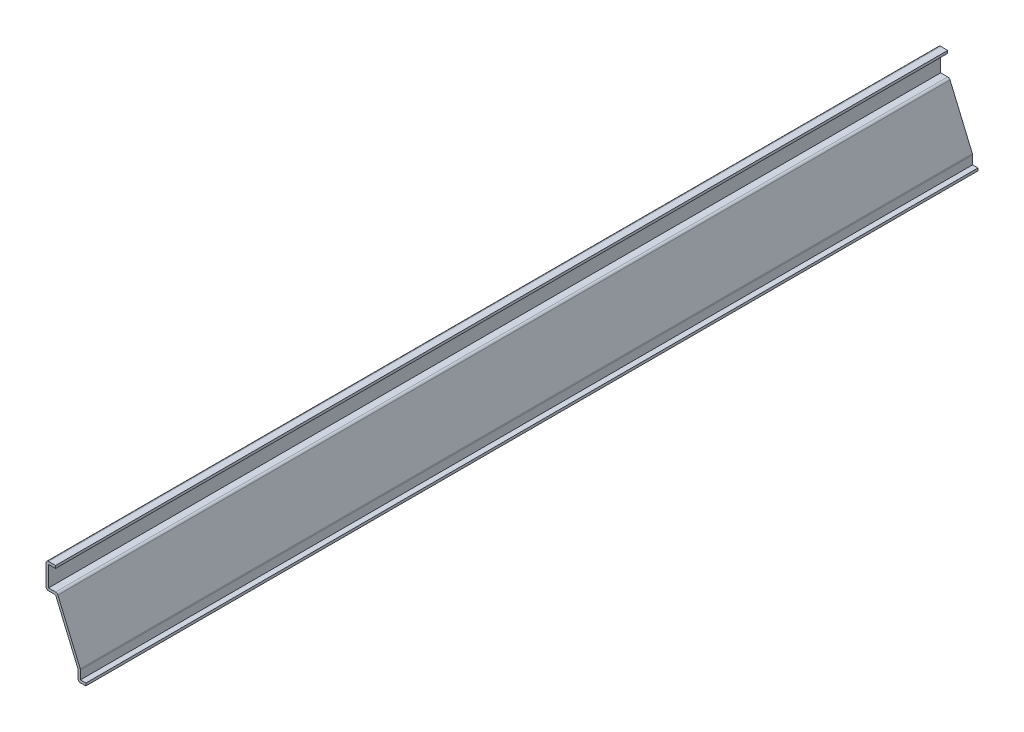
ISO-10303-21;
HEADER;
FILE_DESCRIPTION(('STEP AP214'),'2;1');
FILE_NAME('part.step','',(''),(''),'','','');
FILE_SCHEMA(('AUTOMOTIVE_DESIGN { 1 0 10303 214 1 1 1 1 }'));
ENDSEC;
DATA;
#1=APPLICATION_CONTEXT('core data for automotive mechanical design processes');
#2=APPLICATION_PROTOCOL_DEFINITION('international standard','automotive_design',2000,#1);
#3=PRODUCT_CONTEXT('',#1,'mechanical');
#4=PRODUCT('Part','Part','',(#3));
#5=PRODUCT_RELATED_PRODUCT_CATEGORY('part','',(#4));
#6=PRODUCT_DEFINITION_FORMATION('','',#4);
#7=PRODUCT_DEFINITION_CONTEXT('part definition',#1,'design');
#8=PRODUCT_DEFINITION('design','',#6,#7);
#9=PRODUCT_DEFINITION_SHAPE('','',#8);
#10=(LENGTH_UNIT() NAMED_UNIT(*) SI_UNIT(.MILLI.,.METRE.));
#11=(NAMED_UNIT(*) PLANE_ANGLE_UNIT() SI_UNIT($,.RADIAN.));
#12=(NAMED_UNIT(*) SI_UNIT($,.STERADIAN.) SOLID_ANGLE_UNIT());
#13=UNCERTAINTY_MEASURE_WITH_UNIT(LENGTH_MEASURE(1.E-05),#10,'distance_accuracy_value','');
#14=(GEOMETRIC_REPRESENTATION_CONTEXT(3) GLOBAL_UNCERTAINTY_ASSIGNED_CONTEXT((#13)) GLOBAL_UNIT_ASSIGNED_CONTEXT((#10,
#11,#12)) REPRESENTATION_CONTEXT('',''));
#15=CARTESIAN_POINT('',(0.,0.,0.));
#16=DIRECTION('',(0.,0.,1.));
#17=DIRECTION('',(1.,0.,0.));
#18=AXIS2_PLACEMENT_3D('',#15,#16,#17);
#19=CARTESIAN_POINT('',(-19.84375,43.18,-444.5));
#20=DIRECTION('',(0.,-1.,0.));
#21=DIRECTION('',(0.,0.,-1.));
#22=AXIS2_PLACEMENT_3D('',#19,#20,#21);
#23=PLANE('',#22);
#24=DIRECTION('',(1.,0.,0.));
#25=VECTOR('',#24,1.);
#26=CARTESIAN_POINT('',(-19.84375,43.18,0.));
#27=LINE('',#26,#25);
#28=CARTESIAN_POINT('',(-18.57375,43.18,0.));
#29=VERTEX_POINT('',#28);
#30=CARTESIAN_POINT('',(-15.08125,43.18,0.));
#31=VERTEX_POINT('',#30);
#32=EDGE_CURVE('E224',#29,#31,#27,.T.);
#33=ORIENTED_EDGE('',*,*,#32,.F.);
#34=DIRECTION('',(0.,0.,1.));
#35=VECTOR('',#34,1.);
#36=CARTESIAN_POINT('',(-18.57375,43.18,-444.5));
#37=LINE('',#36,#35);
#38=CARTESIAN_POINT('',(-18.57375,43.18,-444.5));
#39=VERTEX_POINT('',#38);
#40=EDGE_CURVE('E191',#39,#29,#37,.T.);
#41=ORIENTED_EDGE('',*,*,#40,.F.);
#42=DIRECTION('',(1.,0.,0.));
#43=VECTOR('',#42,1.);
#44=CARTESIAN_POINT('',(-19.84375,43.18,-444.5));
#45=LINE('',#44,#43);
#46=CARTESIAN_POINT('',(-15.08125,43.18,-444.5));
#47=VERTEX_POINT('',#46);
#48=EDGE_CURVE('E173',#39,#47,#45,.T.);
#49=ORIENTED_EDGE('',*,*,#48,.T.);
#50=DIRECTION('',(0.,0.,1.));
#51=VECTOR('',#50,1.);
#52=CARTESIAN_POINT('',(-15.08125,43.18,-444.5));
#53=LINE('',#52,#51);
#54=EDGE_CURVE('E181',#47,#31,#53,.T.);
#55=ORIENTED_EDGE('',*,*,#54,.T.);
#56=EDGE_LOOP('',(#33,#41,#49,#55));
#57=FACE_BOUND('',#56,.T.);
#58=ADVANCED_FACE('F35',(#57),#23,.T.);
#59=CARTESIAN_POINT('',(-18.57375,31.75,-444.5));
#60=DIRECTION('',(1.,0.,0.));
#61=DIRECTION('',(0.,0.,-1.));
#62=AXIS2_PLACEMENT_3D('',#59,#60,#61);
#63=PLANE('',#62);
#64=DIRECTION('',(0.,1.,0.));
#65=VECTOR('',#64,1.);
#66=CARTESIAN_POINT('',(-18.57375,31.75,0.));
#67=LINE('',#66,#65);
#68=CARTESIAN_POINT('',(-18.57375,33.02,0.));
#69=VERTEX_POINT('',#68);
#70=EDGE_CURVE('E192',#69,#29,#67,.T.);
#71=ORIENTED_EDGE('',*,*,#70,.F.);
#72=DIRECTION('',(0.,0.,1.));
#73=VECTOR('',#72,1.);
#74=CARTESIAN_POINT('',(-18.57375,33.02,-444.5));
#75=LINE('',#74,#73);
#76=CARTESIAN_POINT('',(-18.57375,33.02,-444.5));
#77=VERTEX_POINT('',#76);
#78=EDGE_CURVE('E255',#77,#69,#75,.T.);
#79=ORIENTED_EDGE('',*,*,#78,.F.);
#80=DIRECTION('',(0.,1.,0.));
#81=VECTOR('',#80,1.);
#82=CARTESIAN_POINT('',(-18.57375,31.75,-444.5));
#83=LINE('',#82,#81);
#84=EDGE_CURVE('E189',#77,#39,#83,.T.);
#85=ORIENTED_EDGE('',*,*,#84,.T.);
#86=ORIENTED_EDGE('',*,*,#40,.T.);
#87=EDGE_LOOP('',(#71,#79,#85,#86));
#88=FACE_BOUND('',#87,.T.);
#89=ADVANCED_FACE('F333',(#88),#63,.T.);
#90=CARTESIAN_POINT('',(-15.08125,33.02,-444.5));
#91=DIRECTION('',(0.,1.,0.));
#92=DIRECTION('',(0.,0.,1.));
#93=AXIS2_PLACEMENT_3D('',#90,#91,#92);
#94=PLANE('',#93);
#95=DIRECTION('',(1.,0.,0.));
#96=VECTOR('',#95,1.);
#97=CARTESIAN_POINT('',(-15.08125,33.02,0.));
#98=LINE('',#97,#96);
#99=CARTESIAN_POINT('',(-15.08125,33.02,0.));
#100=VERTEX_POINT('',#99);
#101=EDGE_CURVE('E195',#100,#69,#98,.F.);
#102=ORIENTED_EDGE('',*,*,#101,.F.);
#103=DIRECTION('',(0.,0.,1.));
#104=VECTOR('',#103,1.);
#105=CARTESIAN_POINT('',(-15.08125,33.02,-444.5));
#106=LINE('',#105,#104);
#107=CARTESIAN_POINT('',(-15.08125,33.02,-444.5));
#108=VERTEX_POINT('',#107);
#109=EDGE_CURVE('E303',#100,#108,#106,.F.);
#110=ORIENTED_EDGE('',*,*,#109,.T.);
#111=DIRECTION('',(1.,0.,0.));
#112=VECTOR('',#111,1.);
#113=CARTESIAN_POINT('',(-15.08125,33.02,-444.5));
#114=LINE('',#113,#112);
#115=EDGE_CURVE('E221',#108,#77,#114,.F.);
#116=ORIENTED_EDGE('',*,*,#115,.T.);
#117=ORIENTED_EDGE('',*,*,#78,.T.);
#118=EDGE_LOOP('',(#102,#110,#116,#117));
#119=FACE_BOUND('',#118,.T.);
#120=ADVANCED_FACE('F392',(#119),#94,.T.);
#121=CARTESIAN_POINT('',(-2.79961113701842,6.05224830550733,-444.5));
#122=DIRECTION('',(0.920581781875257,0.39054984685617,0.));
#123=DIRECTION('',(-0.39054984685617,0.920581781875257,0.));
#124=AXIS2_PLACEMENT_3D('',#121,#122,#123);
#125=PLANE('',#124);
#126=DIRECTION('',(-0.39054984685617,0.920581781875257,0.));
#127=VECTOR('',#126,1.);
#128=CARTESIAN_POINT('',(-2.79961113701842,6.05224830550733,0.));
#129=LINE('',#128,#127);
#130=CARTESIAN_POINT('',(-2.79961113701842,6.05224830550733,0.));
#131=VERTEX_POINT('',#130);
#132=CARTESIAN_POINT('',(-13.9121111370184,32.2459983055073,0.));
#133=VERTEX_POINT('',#132);
#134=EDGE_CURVE('E249',#131,#133,#129,.T.);
#135=ORIENTED_EDGE('',*,*,#134,.F.);
#136=DIRECTION('',(0.,0.,1.));
#137=VECTOR('',#136,1.);
#138=CARTESIAN_POINT('',(-2.79961113701842,6.05224830550733,-444.5));
#139=LINE('',#138,#137);
#140=CARTESIAN_POINT('',(-2.79961113701842,6.05224830550733,-444.5));
#141=VERTEX_POINT('',#140);
#142=EDGE_CURVE('E301',#131,#141,#139,.F.);
#143=ORIENTED_EDGE('',*,*,#142,.T.);
#144=DIRECTION('',(-0.39054984685617,0.920581781875257,0.));
#145=VECTOR('',#144,1.);
#146=CARTESIAN_POINT('',(-2.79961113701842,6.05224830550733,-444.5));
#147=LINE('',#146,#145);
#148=CARTESIAN_POINT('',(-13.9121111370184,32.2459983055073,-444.5));
#149=VERTEX_POINT('',#148);
#150=EDGE_CURVE('E218',#141,#149,#147,.T.);
#151=ORIENTED_EDGE('',*,*,#150,.T.);
#152=DIRECTION('',(0.,0.,1.));
#153=VECTOR('',#152,1.);
#154=CARTESIAN_POINT('',(-13.9121111370184,32.2459983055073,-444.5));
#155=LINE('',#154,#153);
#156=EDGE_CURVE('E298',#149,#133,#155,.T.);
#157=ORIENTED_EDGE('',*,*,#156,.T.);
#158=EDGE_LOOP('',(#135,#143,#151,#157));
#159=FACE_BOUND('',#158,.T.);
#160=ADVANCED_FACE('F344',(#159),#125,.T.);
#161=CARTESIAN_POINT('',(-2.69875,0.,-444.5));
#162=DIRECTION('',(1.,0.,0.));
#163=DIRECTION('',(0.,0.,-1.));
#164=AXIS2_PLACEMENT_3D('',#161,#162,#163);
#165=PLANE('',#164);
#166=DIRECTION('',(0.,1.,0.));
#167=VECTOR('',#166,1.);
#168=CARTESIAN_POINT('',(-2.69875,0.,-444.5));
#169=LINE('',#168,#167);
#170=CARTESIAN_POINT('',(-2.69875,1.27,-444.5));
#171=VERTEX_POINT('',#170);
#172=CARTESIAN_POINT('',(-2.69875,5.55625,-444.5));
#173=VERTEX_POINT('',#172);
#174=EDGE_CURVE('E215',#171,#173,#169,.T.);
#175=ORIENTED_EDGE('',*,*,#174,.T.);
#176=DIRECTION('',(0.,0.,1.));
#177=VECTOR('',#176,1.);
#178=CARTESIAN_POINT('',(-2.69875,5.55625,-444.5));
#179=LINE('',#178,#177);
#180=CARTESIAN_POINT('',(-2.69875,5.55625,0.));
#181=VERTEX_POINT('',#180);
#182=EDGE_CURVE('E295',#173,#181,#179,.T.);
#183=ORIENTED_EDGE('',*,*,#182,.T.);
#184=DIRECTION('',(0.,1.,0.));
#185=VECTOR('',#184,1.);
#186=CARTESIAN_POINT('',(-2.69875,0.,0.));
#187=LINE('',#186,#185);
#188=CARTESIAN_POINT('',(-2.69875,1.27,0.));
#189=VERTEX_POINT('',#188);
#190=EDGE_CURVE('E246',#189,#181,#187,.T.);
#191=ORIENTED_EDGE('',*,*,#190,.F.);
#192=DIRECTION('',(0.,0.,1.));
#193=VECTOR('',#192,1.);
#194=CARTESIAN_POINT('',(-2.69875,1.27,-444.5));
#195=LINE('',#194,#193);
#196=EDGE_CURVE('E258',#171,#189,#195,.T.);
#197=ORIENTED_EDGE('',*,*,#196,.F.);
#198=EDGE_LOOP('',(#175,#183,#191,#197));
#199=FACE_BOUND('',#198,.T.);
#200=ADVANCED_FACE('F352',(#199),#165,.T.);
#201=CARTESIAN_POINT('',(0.,1.27,-444.5));
#202=DIRECTION('',(0.,1.,0.));
#203=DIRECTION('',(0.,0.,1.));
#204=AXIS2_PLACEMENT_3D('',#201,#202,#203);
#205=PLANE('',#204);
#206=DIRECTION('',(1.,0.,0.));
#207=VECTOR('',#206,1.);
#208=CARTESIAN_POINT('',(0.,1.27,0.));
#209=LINE('',#208,#207);
#210=CARTESIAN_POINT('',(0.,1.27,0.));
#211=VERTEX_POINT('',#210);
#212=EDGE_CURVE('E243',#211,#189,#209,.F.);
#213=ORIENTED_EDGE('',*,*,#212,.F.);
#214=DIRECTION('',(0.,0.,1.));
#215=VECTOR('',#214,1.);
#216=CARTESIAN_POINT('',(0.,1.27,-444.5));
#217=LINE('',#216,#215);
#218=CARTESIAN_POINT('',(0.,1.27,-444.5));
#219=VERTEX_POINT('',#218);
#220=EDGE_CURVE('E260',#219,#211,#217,.T.);
#221=ORIENTED_EDGE('',*,*,#220,.F.);
#222=DIRECTION('',(1.,0.,0.));
#223=VECTOR('',#222,1.);
#224=CARTESIAN_POINT('',(0.,1.27,-444.5));
#225=LINE('',#224,#223);
#226=EDGE_CURVE('E212',#219,#171,#225,.F.);
#227=ORIENTED_EDGE('',*,*,#226,.T.);
#228=ORIENTED_EDGE('',*,*,#196,.T.);
#229=EDGE_LOOP('',(#213,#221,#227,#228));
#230=FACE_BOUND('',#229,.T.);
#231=ADVANCED_FACE('F357',(#230),#205,.T.);
#232=CARTESIAN_POINT('',(0.,1.27,-444.5));
#233=DIRECTION('',(-1.,0.,0.));
#234=DIRECTION('',(0.,0.,1.));
#235=AXIS2_PLACEMENT_3D('',#232,#233,#234);
#236=PLANE('',#235);
#237=DIRECTION('',(0.,-1.,0.));
#238=VECTOR('',#237,1.);
#239=CARTESIAN_POINT('',(0.,1.27,0.));
#240=LINE('',#239,#238);
#241=CARTESIAN_POINT('',(0.,0.,0.));
#242=VERTEX_POINT('',#241);
#243=EDGE_CURVE('E241',#211,#242,#240,.T.);
#244=ORIENTED_EDGE('',*,*,#243,.T.);
#245=DIRECTION('',(0.,0.,1.));
#246=VECTOR('',#245,1.);
#247=CARTESIAN_POINT('',(0.,0.,-444.5));
#248=LINE('',#247,#246);
#249=CARTESIAN_POINT('',(0.,0.,-444.5));
#250=VERTEX_POINT('',#249);
#251=EDGE_CURVE('E262',#250,#242,#248,.T.);
#252=ORIENTED_EDGE('',*,*,#251,.F.);
#253=DIRECTION('',(0.,-1.,0.));
#254=VECTOR('',#253,1.);
#255=CARTESIAN_POINT('',(0.,1.27,-444.5));
#256=LINE('',#255,#254);
#257=EDGE_CURVE('E210',#219,#250,#256,.T.);
#258=ORIENTED_EDGE('',*,*,#257,.F.);
#259=ORIENTED_EDGE('',*,*,#220,.T.);
#260=EDGE_LOOP('',(#244,#252,#258,#259));
#261=FACE_BOUND('',#260,.T.);
#262=ADVANCED_FACE('F362',(#261),#236,.F.);
#263=CARTESIAN_POINT('',(0.,0.,-444.5));
#264=DIRECTION('',(0.,1.,0.));
#265=DIRECTION('',(0.,0.,1.));
#266=AXIS2_PLACEMENT_3D('',#263,#264,#265);
#267=PLANE('',#266);
#268=DIRECTION('',(-1.,0.,0.));
#269=VECTOR('',#268,1.);
#270=CARTESIAN_POINT('',(0.,0.,0.));
#271=LINE('',#270,#269);
#272=CARTESIAN_POINT('',(-2.69875,0.,0.));
#273=VERTEX_POINT('',#272);
#274=EDGE_CURVE('E238',#242,#273,#271,.T.);
#275=ORIENTED_EDGE('',*,*,#274,.T.);
#276=DIRECTION('',(0.,0.,1.));
#277=VECTOR('',#276,1.);
#278=CARTESIAN_POINT('',(-2.69875,0.,-444.5));
#279=LINE('',#278,#277);
#280=CARTESIAN_POINT('',(-2.69875,0.,-444.5));
#281=VERTEX_POINT('',#280);
#282=EDGE_CURVE('E284',#273,#281,#279,.F.);
#283=ORIENTED_EDGE('',*,*,#282,.T.);
#284=DIRECTION('',(-1.,0.,0.));
#285=VECTOR('',#284,1.);
#286=CARTESIAN_POINT('',(0.,0.,-444.5));
#287=LINE('',#286,#285);
#288=EDGE_CURVE('E208',#250,#281,#287,.T.);
#289=ORIENTED_EDGE('',*,*,#288,.F.);
#290=ORIENTED_EDGE('',*,*,#251,.T.);
#291=EDGE_LOOP('',(#275,#283,#289,#290));
#292=FACE_BOUND('',#291,.T.);
#293=ADVANCED_FACE('F385',(#292),#267,.F.);
#294=CARTESIAN_POINT('',(-3.96875,0.,-444.5));
#295=DIRECTION('',(1.,0.,0.));
#296=DIRECTION('',(0.,0.,-1.));
#297=AXIS2_PLACEMENT_3D('',#294,#295,#296);
#298=PLANE('',#297);
#299=DIRECTION('',(0.,1.,0.));
#300=VECTOR('',#299,1.);
#301=CARTESIAN_POINT('',(-3.96875,0.,-444.5));
#302=LINE('',#301,#300);
#303=CARTESIAN_POINT('',(-3.96875,1.27,-444.5));
#304=VERTEX_POINT('',#303);
#305=CARTESIAN_POINT('',(-3.96875,5.55625,-444.5));
#306=VERTEX_POINT('',#305);
#307=EDGE_CURVE('E206',#304,#306,#302,.T.);
#308=ORIENTED_EDGE('',*,*,#307,.F.);
#309=DIRECTION('',(0.,0.,1.));
#310=VECTOR('',#309,1.);
#311=CARTESIAN_POINT('',(-3.96875,1.27,-444.5));
#312=LINE('',#311,#310);
#313=CARTESIAN_POINT('',(-3.96875,1.27,0.));
#314=VERTEX_POINT('',#313);
#315=EDGE_CURVE('E254',#304,#314,#312,.T.);
#316=ORIENTED_EDGE('',*,*,#315,.T.);
#317=DIRECTION('',(0.,1.,0.));
#318=VECTOR('',#317,1.);
#319=CARTESIAN_POINT('',(-3.96875,0.,0.));
#320=LINE('',#319,#318);
#321=CARTESIAN_POINT('',(-3.96875,5.55625,0.));
#322=VERTEX_POINT('',#321);
#323=EDGE_CURVE('E236',#314,#322,#320,.T.);
#324=ORIENTED_EDGE('',*,*,#323,.T.);
#325=DIRECTION('',(0.,0.,1.));
#326=VECTOR('',#325,1.);
#327=CARTESIAN_POINT('',(-3.96875,5.55625,-444.5));
#328=LINE('',#327,#326);
#329=EDGE_CURVE('E265',#306,#322,#328,.T.);
#330=ORIENTED_EDGE('',*,*,#329,.F.);
#331=EDGE_LOOP('',(#308,#316,#324,#330));
#332=FACE_BOUND('',#331,.T.);
#333=ADVANCED_FACE('F372',(#332),#298,.F.);
#334=CARTESIAN_POINT('',(-3.96875,5.55625,-444.5));
#335=DIRECTION('',(0.920581781875257,0.39054984685617,0.));
#336=DIRECTION('',(-0.39054984685617,0.920581781875257,0.));
#337=AXIS2_PLACEMENT_3D('',#334,#335,#336);
#338=PLANE('',#337);
#339=DIRECTION('',(-0.39054984685617,0.920581781875257,0.));
#340=VECTOR('',#339,1.);
#341=CARTESIAN_POINT('',(-3.96875,5.55625,0.));
#342=LINE('',#341,#340);
#343=CARTESIAN_POINT('',(-15.08125,31.75,0.));
#344=VERTEX_POINT('',#343);
#345=EDGE_CURVE('E234',#322,#344,#342,.T.);
#346=ORIENTED_EDGE('',*,*,#345,.T.);
#347=DIRECTION('',(0.,0.,1.));
#348=VECTOR('',#347,1.);
#349=CARTESIAN_POINT('',(-15.08125,31.75,-444.5));
#350=LINE('',#349,#348);
#351=CARTESIAN_POINT('',(-15.08125,31.75,-444.5));
#352=VERTEX_POINT('',#351);
#353=EDGE_CURVE('E268',#352,#344,#350,.T.);
#354=ORIENTED_EDGE('',*,*,#353,.F.);
#355=DIRECTION('',(-0.39054984685617,0.920581781875257,0.));
#356=VECTOR('',#355,1.);
#357=CARTESIAN_POINT('',(-3.96875,5.55625,-444.5));
#358=LINE('',#357,#356);
#359=EDGE_CURVE('E204',#306,#352,#358,.T.);
#360=ORIENTED_EDGE('',*,*,#359,.F.);
#361=ORIENTED_EDGE('',*,*,#329,.T.);
#362=EDGE_LOOP('',(#346,#354,#360,#361));
#363=FACE_BOUND('',#362,.T.);
#364=ADVANCED_FACE('F377',(#363),#338,.F.);
#365=CARTESIAN_POINT('',(-15.08125,31.75,-444.5));
#366=DIRECTION('',(0.,1.,0.));
#367=DIRECTION('',(0.,0.,1.));
#368=AXIS2_PLACEMENT_3D('',#365,#366,#367);
#369=PLANE('',#368);
#370=DIRECTION('',(-1.,0.,0.));
#371=VECTOR('',#370,1.);
#372=CARTESIAN_POINT('',(-15.08125,31.75,0.));
#373=LINE('',#372,#371);
#374=CARTESIAN_POINT('',(-18.57375,31.75,0.));
#375=VERTEX_POINT('',#374);
#376=EDGE_CURVE('E231',#344,#375,#373,.T.);
#377=ORIENTED_EDGE('',*,*,#376,.T.);
#378=DIRECTION('',(0.,0.,1.));
#379=VECTOR('',#378,1.);
#380=CARTESIAN_POINT('',(-18.57375,31.75,-444.5));
#381=LINE('',#380,#379);
#382=CARTESIAN_POINT('',(-18.57375,31.75,-444.5));
#383=VERTEX_POINT('',#382);
#384=EDGE_CURVE('E43',#375,#383,#381,.F.);
#385=ORIENTED_EDGE('',*,*,#384,.T.);
#386=DIRECTION('',(-1.,0.,0.));
#387=VECTOR('',#386,1.);
#388=CARTESIAN_POINT('',(-15.08125,31.75,-444.5));
#389=LINE('',#388,#387);
#390=EDGE_CURVE('E201',#352,#383,#389,.T.);
#391=ORIENTED_EDGE('',*,*,#390,.F.);
#392=ORIENTED_EDGE('',*,*,#353,.T.);
#393=EDGE_LOOP('',(#377,#385,#391,#392));
#394=FACE_BOUND('',#393,.T.);
#395=ADVANCED_FACE('F311',(#394),#369,.F.);
#396=CARTESIAN_POINT('',(-19.84375,31.75,-444.5));
#397=DIRECTION('',(1.,0.,0.));
#398=DIRECTION('',(0.,0.,-1.));
#399=AXIS2_PLACEMENT_3D('',#396,#397,#398);
#400=PLANE('',#399);
#401=DIRECTION('',(0.,1.,0.));
#402=VECTOR('',#401,1.);
#403=CARTESIAN_POINT('',(-19.84375,31.75,-444.5));
#404=LINE('',#403,#402);
#405=CARTESIAN_POINT('',(-19.84375,33.02,-444.5));
#406=VERTEX_POINT('',#405);
#407=CARTESIAN_POINT('',(-19.84375,43.18,-444.5));
#408=VERTEX_POINT('',#407);
#409=EDGE_CURVE('E199',#406,#408,#404,.T.);
#410=ORIENTED_EDGE('',*,*,#409,.F.);
#411=DIRECTION('',(0.,0.,1.));
#412=VECTOR('',#411,1.);
#413=CARTESIAN_POINT('',(-19.84375,33.02,-444.5));
#414=LINE('',#413,#412);
#415=CARTESIAN_POINT('',(-19.84375,33.02,0.));
#416=VERTEX_POINT('',#415);
#417=EDGE_CURVE('E306',#406,#416,#414,.T.);
#418=ORIENTED_EDGE('',*,*,#417,.T.);
#419=DIRECTION('',(0.,1.,0.));
#420=VECTOR('',#419,1.);
#421=CARTESIAN_POINT('',(-19.84375,31.75,0.));
#422=LINE('',#421,#420);
#423=CARTESIAN_POINT('',(-19.84375,43.18,0.));
#424=VERTEX_POINT('',#423);
#425=EDGE_CURVE('E229',#416,#424,#422,.T.);
#426=ORIENTED_EDGE('',*,*,#425,.T.);
#427=DIRECTION('',(0.,0.,1.));
#428=VECTOR('',#427,1.);
#429=CARTESIAN_POINT('',(-19.84375,43.18,-444.5));
#430=LINE('',#429,#428);
#431=EDGE_CURVE('E58',#424,#408,#430,.F.);
#432=ORIENTED_EDGE('',*,*,#431,.T.);
#433=EDGE_LOOP('',(#410,#418,#426,#432));
#434=FACE_BOUND('',#433,.T.);
#435=ADVANCED_FACE('F320',(#434),#400,.F.);
#436=CARTESIAN_POINT('',(-19.84375,44.45,-444.5));
#437=DIRECTION('',(0.,-1.,0.));
#438=DIRECTION('',(0.,0.,-1.));
#439=AXIS2_PLACEMENT_3D('',#436,#437,#438);
#440=PLANE('',#439);
#441=DIRECTION('',(1.,0.,0.));
#442=VECTOR('',#441,1.);
#443=CARTESIAN_POINT('',(-19.84375,44.45,-444.5));
#444=LINE('',#443,#442);
#445=CARTESIAN_POINT('',(-18.57375,44.45,-444.5));
#446=VERTEX_POINT('',#445);
#447=CARTESIAN_POINT('',(-15.08125,44.45,-444.5));
#448=VERTEX_POINT('',#447);
#449=EDGE_CURVE('E175',#446,#448,#444,.T.);
#450=ORIENTED_EDGE('',*,*,#449,.F.);
#451=DIRECTION('',(0.,0.,1.));
#452=VECTOR('',#451,1.);
#453=CARTESIAN_POINT('',(-18.57375,44.45,-444.5));
#454=LINE('',#453,#452);
#455=CARTESIAN_POINT('',(-18.57375,44.45,0.));
#456=VERTEX_POINT('',#455);
#457=EDGE_CURVE('E11',#446,#456,#454,.T.);
#458=ORIENTED_EDGE('',*,*,#457,.T.);
#459=DIRECTION('',(1.,0.,0.));
#460=VECTOR('',#459,1.);
#461=CARTESIAN_POINT('',(-19.84375,44.45,0.));
#462=LINE('',#461,#460);
#463=CARTESIAN_POINT('',(-15.08125,44.45,0.));
#464=VERTEX_POINT('',#463);
#465=EDGE_CURVE('E227',#456,#464,#462,.T.);
#466=ORIENTED_EDGE('',*,*,#465,.T.);
#467=DIRECTION('',(0.,0.,1.));
#468=VECTOR('',#467,1.);
#469=CARTESIAN_POINT('',(-15.08125,44.45,-444.5));
#470=LINE('',#469,#468);
#471=EDGE_CURVE('E188',#448,#464,#470,.T.);
#472=ORIENTED_EDGE('',*,*,#471,.F.);
#473=EDGE_LOOP('',(#450,#458,#466,#472));
#474=FACE_BOUND('',#473,.T.);
#475=ADVANCED_FACE('F328',(#474),#440,.F.);
#476=CARTESIAN_POINT('',(-15.08125,44.45,-444.5));
#477=DIRECTION('',(-1.,0.,0.));
#478=DIRECTION('',(0.,0.,1.));
#479=AXIS2_PLACEMENT_3D('',#476,#477,#478);
#480=PLANE('',#479);
#481=DIRECTION('',(0.,-1.,0.));
#482=VECTOR('',#481,1.);
#483=CARTESIAN_POINT('',(-15.08125,44.45,0.));
#484=LINE('',#483,#482);
#485=EDGE_CURVE('E184',#464,#31,#484,.T.);
#486=ORIENTED_EDGE('',*,*,#485,.T.);
#487=ORIENTED_EDGE('',*,*,#54,.F.);
#488=DIRECTION('',(0.,-1.,0.));
#489=VECTOR('',#488,1.);
#490=CARTESIAN_POINT('',(-15.08125,44.45,-444.5));
#491=LINE('',#490,#489);
#492=EDGE_CURVE('E167',#448,#47,#491,.T.);
#493=ORIENTED_EDGE('',*,*,#492,.F.);
#494=ORIENTED_EDGE('',*,*,#471,.T.);
#495=EDGE_LOOP('',(#486,#487,#493,#494));
#496=FACE_BOUND('',#495,.T.);
#497=ADVANCED_FACE('F182',(#496),#480,.F.);
#498=CARTESIAN_POINT('',(0.,0.,-444.5));
#499=DIRECTION('',(0.,0.,-1.));
#500=DIRECTION('',(-1.,0.,0.));
#501=AXIS2_PLACEMENT_3D('',#498,#499,#500);
#502=PLANE('',#501);
#503=ORIENTED_EDGE('',*,*,#288,.T.);
#504=CARTESIAN_POINT('',(-2.69875,1.27,-444.5));
#505=DIRECTION('',(0.,0.,-1.));
#506=DIRECTION('',(-1.,0.,0.));
#507=AXIS2_PLACEMENT_3D('',#504,#505,#506);
#508=CIRCLE('',#507,1.27);
#509=EDGE_CURVE('E293',#281,#304,#508,.T.);
#510=ORIENTED_EDGE('',*,*,#509,.T.);
#511=ORIENTED_EDGE('',*,*,#307,.T.);
#512=ORIENTED_EDGE('',*,*,#359,.T.);
#513=ORIENTED_EDGE('',*,*,#390,.T.);
#514=CARTESIAN_POINT('',(-18.57375,33.02,-444.5));
#515=DIRECTION('',(0.,0.,-1.));
#516=DIRECTION('',(-1.,0.,0.));
#517=AXIS2_PLACEMENT_3D('',#514,#515,#516);
#518=CIRCLE('',#517,1.27);
#519=EDGE_CURVE('E287',#383,#406,#518,.T.);
#520=ORIENTED_EDGE('',*,*,#519,.T.);
#521=ORIENTED_EDGE('',*,*,#409,.T.);
#522=CARTESIAN_POINT('',(-18.57375,43.18,-444.5));
#523=DIRECTION('',(0.,0.,-1.));
#524=DIRECTION('',(-1.,0.,0.));
#525=AXIS2_PLACEMENT_3D('',#522,#523,#524);
#526=CIRCLE('',#525,1.27);
#527=EDGE_CURVE('E50',#408,#446,#526,.T.);
#528=ORIENTED_EDGE('',*,*,#527,.T.);
#529=ORIENTED_EDGE('',*,*,#449,.T.);
#530=ORIENTED_EDGE('',*,*,#492,.T.);
#531=ORIENTED_EDGE('',*,*,#48,.F.);
#532=ORIENTED_EDGE('',*,*,#84,.F.);
#533=ORIENTED_EDGE('',*,*,#115,.F.);
#534=CARTESIAN_POINT('',(-15.08125,31.75,-444.5));
#535=DIRECTION('',(0.,0.,-1.));
#536=DIRECTION('',(-1.,0.,0.));
#537=AXIS2_PLACEMENT_3D('',#534,#535,#536);
#538=CIRCLE('',#537,1.27);
#539=EDGE_CURVE('E289',#108,#149,#538,.T.);
#540=ORIENTED_EDGE('',*,*,#539,.T.);
#541=ORIENTED_EDGE('',*,*,#150,.F.);
#542=CARTESIAN_POINT('',(-3.96875,5.55625,-444.5));
#543=DIRECTION('',(0.,0.,-1.));
#544=DIRECTION('',(-1.,0.,0.));
#545=AXIS2_PLACEMENT_3D('',#542,#543,#544);
#546=CIRCLE('',#545,1.27);
#547=EDGE_CURVE('E291',#141,#173,#546,.T.);
#548=ORIENTED_EDGE('',*,*,#547,.T.);
#549=ORIENTED_EDGE('',*,*,#174,.F.);
#550=ORIENTED_EDGE('',*,*,#226,.F.);
#551=ORIENTED_EDGE('',*,*,#257,.T.);
#552=EDGE_LOOP('',(#503,#510,#511,#512,#513,#520,#521,#528,#529,#530,#531,#532,#533,#540,#541,
#548,#549,#550,#551));
#553=FACE_BOUND('',#552,.T.);
#554=ADVANCED_FACE('F170',(#553),#502,.T.);
#555=CARTESIAN_POINT('',(0.,0.,0.));
#556=DIRECTION('',(0.,0.,-1.));
#557=DIRECTION('',(-1.,0.,0.));
#558=AXIS2_PLACEMENT_3D('',#555,#556,#557);
#559=PLANE('',#558);
#560=ORIENTED_EDGE('',*,*,#323,.F.);
#561=CARTESIAN_POINT('',(-2.69875,1.27,0.));
#562=DIRECTION('',(0.,0.,-1.));
#563=DIRECTION('',(-1.,0.,0.));
#564=AXIS2_PLACEMENT_3D('',#561,#562,#563);
#565=CIRCLE('',#564,1.27);
#566=EDGE_CURVE('E282',#314,#273,#565,.F.);
#567=ORIENTED_EDGE('',*,*,#566,.T.);
#568=ORIENTED_EDGE('',*,*,#274,.F.);
#569=ORIENTED_EDGE('',*,*,#243,.F.);
#570=ORIENTED_EDGE('',*,*,#212,.T.);
#571=ORIENTED_EDGE('',*,*,#190,.T.);
#572=CARTESIAN_POINT('',(-3.96875,5.55625,0.));
#573=DIRECTION('',(0.,0.,-1.));
#574=DIRECTION('',(-1.,0.,0.));
#575=AXIS2_PLACEMENT_3D('',#572,#573,#574);
#576=CIRCLE('',#575,1.27);
#577=EDGE_CURVE('E280',#181,#131,#576,.F.);
#578=ORIENTED_EDGE('',*,*,#577,.T.);
#579=ORIENTED_EDGE('',*,*,#134,.T.);
#580=CARTESIAN_POINT('',(-15.08125,31.75,0.));
#581=DIRECTION('',(0.,0.,-1.));
#582=DIRECTION('',(-1.,0.,0.));
#583=AXIS2_PLACEMENT_3D('',#580,#581,#582);
#584=CIRCLE('',#583,1.27);
#585=EDGE_CURVE('E278',#133,#100,#584,.F.);
#586=ORIENTED_EDGE('',*,*,#585,.T.);
#587=ORIENTED_EDGE('',*,*,#101,.T.);
#588=ORIENTED_EDGE('',*,*,#70,.T.);
#589=ORIENTED_EDGE('',*,*,#32,.T.);
#590=ORIENTED_EDGE('',*,*,#485,.F.);
#591=ORIENTED_EDGE('',*,*,#465,.F.);
#592=CARTESIAN_POINT('',(-18.57375,43.18,0.));
#593=DIRECTION('',(0.,0.,-1.));
#594=DIRECTION('',(-1.,0.,0.));
#595=AXIS2_PLACEMENT_3D('',#592,#593,#594);
#596=CIRCLE('',#595,1.27);
#597=EDGE_CURVE('E274',#456,#424,#596,.F.);
#598=ORIENTED_EDGE('',*,*,#597,.T.);
#599=ORIENTED_EDGE('',*,*,#425,.F.);
#600=CARTESIAN_POINT('',(-18.57375,33.02,0.));
#601=DIRECTION('',(0.,0.,-1.));
#602=DIRECTION('',(-1.,0.,0.));
#603=AXIS2_PLACEMENT_3D('',#600,#601,#602);
#604=CIRCLE('',#603,1.27);
#605=EDGE_CURVE('E276',#416,#375,#604,.F.);
#606=ORIENTED_EDGE('',*,*,#605,.T.);
#607=ORIENTED_EDGE('',*,*,#376,.F.);
#608=ORIENTED_EDGE('',*,*,#345,.F.);
#609=EDGE_LOOP('',(#560,#567,#568,#569,#570,#571,#578,#579,#586,#587,#588,#589,#590,#591,#598,
#599,#606,#607,#608));
#610=FACE_BOUND('',#609,.T.);
#611=ADVANCED_FACE('F323',(#610),#559,.F.);
#612=CARTESIAN_POINT('',(-2.69875,1.27,-444.5));
#613=DIRECTION('',(0.,0.,1.));
#614=DIRECTION('',(1.,0.,0.));
#615=AXIS2_PLACEMENT_3D('',#612,#613,#614);
#616=CYLINDRICAL_SURFACE('',#615,1.27);
#617=ORIENTED_EDGE('',*,*,#509,.F.);
#618=ORIENTED_EDGE('',*,*,#282,.F.);
#619=ORIENTED_EDGE('',*,*,#566,.F.);
#620=ORIENTED_EDGE('',*,*,#315,.F.);
#621=EDGE_LOOP('',(#617,#618,#619,#620));
#622=FACE_BOUND('',#621,.T.);
#623=ADVANCED_FACE('F370',(#622),#616,.T.);
#624=CARTESIAN_POINT('',(-3.96875,5.55625,-444.5));
#625=DIRECTION('',(0.,0.,1.));
#626=DIRECTION('',(1.,0.,0.));
#627=AXIS2_PLACEMENT_3D('',#624,#625,#626);
#628=CYLINDRICAL_SURFACE('',#627,1.27);
#629=ORIENTED_EDGE('',*,*,#547,.F.);
#630=ORIENTED_EDGE('',*,*,#142,.F.);
#631=ORIENTED_EDGE('',*,*,#577,.F.);
#632=ORIENTED_EDGE('',*,*,#182,.F.);
#633=EDGE_LOOP('',(#629,#630,#631,#632));
#634=FACE_BOUND('',#633,.T.);
#635=ADVANCED_FACE('F350',(#634),#628,.T.);
#636=CARTESIAN_POINT('',(-15.08125,31.75,-444.5));
#637=DIRECTION('',(0.,0.,1.));
#638=DIRECTION('',(1.,0.,0.));
#639=AXIS2_PLACEMENT_3D('',#636,#637,#638);
#640=CYLINDRICAL_SURFACE('',#639,1.27);
#641=ORIENTED_EDGE('',*,*,#539,.F.);
#642=ORIENTED_EDGE('',*,*,#109,.F.);
#643=ORIENTED_EDGE('',*,*,#585,.F.);
#644=ORIENTED_EDGE('',*,*,#156,.F.);
#645=EDGE_LOOP('',(#641,#642,#643,#644));
#646=FACE_BOUND('',#645,.T.);
#647=ADVANCED_FACE('F341',(#646),#640,.T.);
#648=CARTESIAN_POINT('',(-18.57375,33.02,-444.5));
#649=DIRECTION('',(0.,0.,1.));
#650=DIRECTION('',(1.,0.,0.));
#651=AXIS2_PLACEMENT_3D('',#648,#649,#650);
#652=CYLINDRICAL_SURFACE('',#651,1.27);
#653=ORIENTED_EDGE('',*,*,#519,.F.);
#654=ORIENTED_EDGE('',*,*,#384,.F.);
#655=ORIENTED_EDGE('',*,*,#605,.F.);
#656=ORIENTED_EDGE('',*,*,#417,.F.);
#657=EDGE_LOOP('',(#653,#654,#655,#656));
#658=FACE_BOUND('',#657,.T.);
#659=ADVANCED_FACE('F318',(#658),#652,.T.);
#660=CARTESIAN_POINT('',(-18.57375,43.18,-444.5));
#661=DIRECTION('',(0.,0.,1.));
#662=DIRECTION('',(1.,0.,0.));
#663=AXIS2_PLACEMENT_3D('',#660,#661,#662);
#664=CYLINDRICAL_SURFACE('',#663,1.27);
#665=ORIENTED_EDGE('',*,*,#527,.F.);
#666=ORIENTED_EDGE('',*,*,#431,.F.);
#667=ORIENTED_EDGE('',*,*,#597,.F.);
#668=ORIENTED_EDGE('',*,*,#457,.F.);
#669=EDGE_LOOP('',(#665,#666,#667,#668));
#670=FACE_BOUND('',#669,.T.);
#671=ADVANCED_FACE('F37',(#670),#664,.T.);
#672=CLOSED_SHELL('',(#58,#89,#120,#160,#200,#231,#262,#293,#333,#364,#395,#435,#475,#497,#554,
#611,#623,#635,#647,#659,#671));
#673=MANIFOLD_SOLID_BREP('B2',#672);
#674=ADVANCED_BREP_SHAPE_REPRESENTATION('',(#18,#673),#14);
#675=SHAPE_DEFINITION_REPRESENTATION(#9,#674);
ENDSEC;
END-ISO-10303-21;
